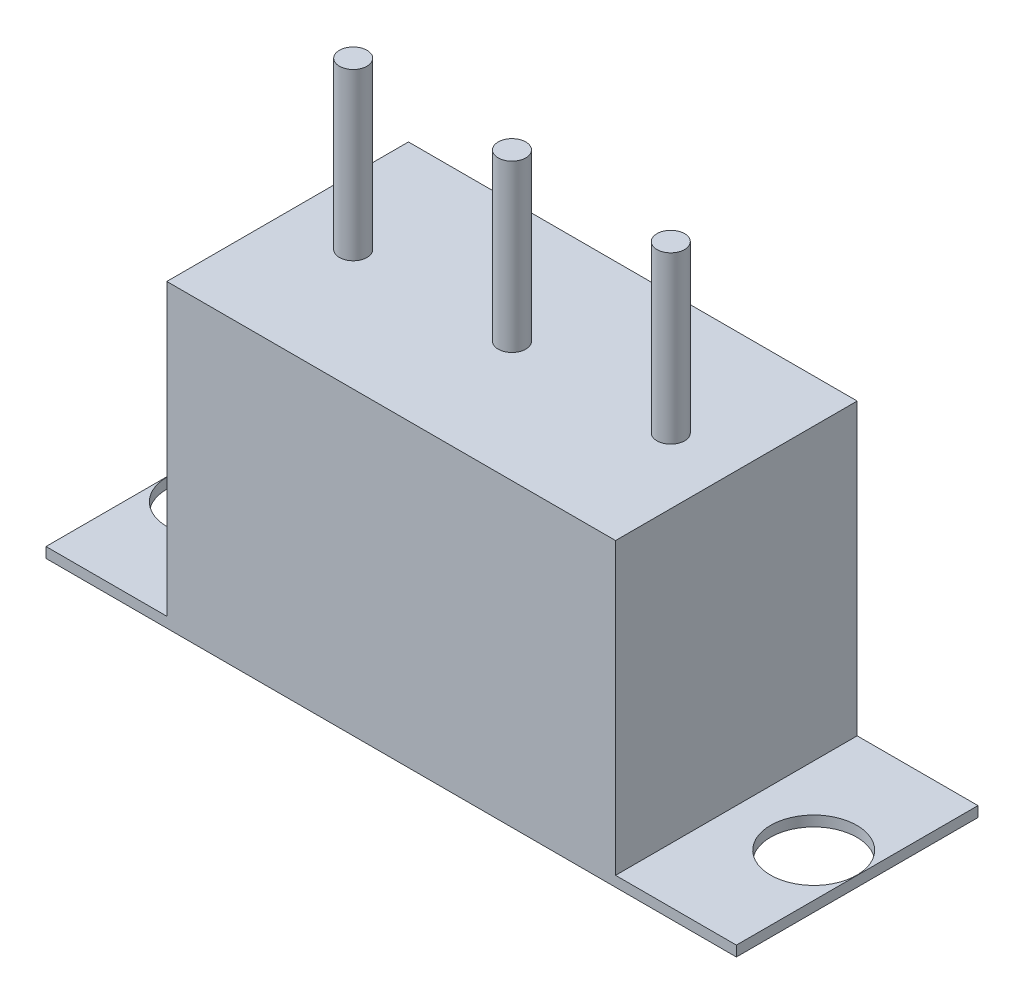
ISO-10303-21;
HEADER;
FILE_DESCRIPTION(('STEP AP214'),'2;1');
FILE_NAME('part.step','',(''),(''),'','','');
FILE_SCHEMA(('AUTOMOTIVE_DESIGN { 1 0 10303 214 1 1 1 1 }'));
ENDSEC;
DATA;
#1=APPLICATION_CONTEXT('core data for automotive mechanical design processes');
#2=APPLICATION_PROTOCOL_DEFINITION('international standard','automotive_design',2000,#1);
#3=PRODUCT_CONTEXT('',#1,'mechanical');
#4=PRODUCT('Part','Part','',(#3));
#5=PRODUCT_RELATED_PRODUCT_CATEGORY('part','',(#4));
#6=PRODUCT_DEFINITION_FORMATION('','',#4);
#7=PRODUCT_DEFINITION_CONTEXT('part definition',#1,'design');
#8=PRODUCT_DEFINITION('design','',#6,#7);
#9=PRODUCT_DEFINITION_SHAPE('','',#8);
#10=(LENGTH_UNIT() NAMED_UNIT(*) SI_UNIT(.MILLI.,.METRE.));
#11=(NAMED_UNIT(*) PLANE_ANGLE_UNIT() SI_UNIT($,.RADIAN.));
#12=(NAMED_UNIT(*) SI_UNIT($,.STERADIAN.) SOLID_ANGLE_UNIT());
#13=UNCERTAINTY_MEASURE_WITH_UNIT(LENGTH_MEASURE(1.E-05),#10,'distance_accuracy_value','');
#14=(GEOMETRIC_REPRESENTATION_CONTEXT(3) GLOBAL_UNCERTAINTY_ASSIGNED_CONTEXT((#13)) GLOBAL_UNIT_ASSIGNED_CONTEXT((#10,
#11,#12)) REPRESENTATION_CONTEXT('',''));
#15=CARTESIAN_POINT('',(0.,0.,0.));
#16=DIRECTION('',(0.,0.,1.));
#17=DIRECTION('',(1.,0.,0.));
#18=AXIS2_PLACEMENT_3D('',#15,#16,#17);
#19=CARTESIAN_POINT('',(0.,8.7,0.));
#20=DIRECTION('',(0.,1.,0.));
#21=DIRECTION('',(0.,0.,1.));
#22=AXIS2_PLACEMENT_3D('',#19,#20,#21);
#23=PLANE('',#22);
#24=CARTESIAN_POINT('',(0.,8.7,0.));
#25=DIRECTION('',(0.,1.,0.));
#26=DIRECTION('',(0.,0.,1.));
#27=AXIS2_PLACEMENT_3D('',#24,#25,#26);
#28=CIRCLE('',#27,0.4);
#29=CARTESIAN_POINT('',(0.,8.7,0.4));
#30=VERTEX_POINT('',#29);
#31=EDGE_CURVE('E174',#30,#30,#28,.T.);
#32=ORIENTED_EDGE('',*,*,#31,.F.);
#33=EDGE_LOOP('',(#32));
#34=FACE_BOUND('',#33,.T.);
#35=DIRECTION('',(0.,0.,1.));
#36=VECTOR('',#35,1.);
#37=CARTESIAN_POINT('',(-6.5,8.7,3.5));
#38=LINE('',#37,#36);
#39=CARTESIAN_POINT('',(-6.5,8.7,-3.5));
#40=VERTEX_POINT('',#39);
#41=CARTESIAN_POINT('',(-6.5,8.7,3.5));
#42=VERTEX_POINT('',#41);
#43=EDGE_CURVE('E109',#40,#42,#38,.T.);
#44=ORIENTED_EDGE('',*,*,#43,.T.);
#45=DIRECTION('',(1.,0.,0.));
#46=VECTOR('',#45,1.);
#47=CARTESIAN_POINT('',(6.5,8.7,3.5));
#48=LINE('',#47,#46);
#49=CARTESIAN_POINT('',(6.5,8.7,3.5));
#50=VERTEX_POINT('',#49);
#51=EDGE_CURVE('E99',#42,#50,#48,.T.);
#52=ORIENTED_EDGE('',*,*,#51,.T.);
#53=DIRECTION('',(0.,0.,-1.));
#54=VECTOR('',#53,1.);
#55=CARTESIAN_POINT('',(6.5,8.7,3.5));
#56=LINE('',#55,#54);
#57=CARTESIAN_POINT('',(6.5,8.7,-3.5));
#58=VERTEX_POINT('',#57);
#59=EDGE_CURVE('E108',#50,#58,#56,.T.);
#60=ORIENTED_EDGE('',*,*,#59,.T.);
#61=DIRECTION('',(-1.,0.,0.));
#62=VECTOR('',#61,1.);
#63=CARTESIAN_POINT('',(6.5,8.7,-3.5));
#64=LINE('',#63,#62);
#65=EDGE_CURVE('E114',#58,#40,#64,.T.);
#66=ORIENTED_EDGE('',*,*,#65,.T.);
#67=EDGE_LOOP('',(#44,#52,#60,#66));
#68=FACE_BOUND('',#67,.T.);
#69=CARTESIAN_POINT('',(-4.6,8.7,0.));
#70=DIRECTION('',(0.,1.,0.));
#71=DIRECTION('',(0.,0.,1.));
#72=AXIS2_PLACEMENT_3D('',#69,#70,#71);
#73=CIRCLE('',#72,0.4);
#74=CARTESIAN_POINT('',(-4.6,8.7,0.4));
#75=VERTEX_POINT('',#74);
#76=EDGE_CURVE('E168',#75,#75,#73,.T.);
#77=ORIENTED_EDGE('',*,*,#76,.F.);
#78=EDGE_LOOP('',(#77));
#79=FACE_BOUND('',#78,.T.);
#80=CARTESIAN_POINT('',(4.6,8.7,0.));
#81=DIRECTION('',(0.,1.,0.));
#82=DIRECTION('',(0.,0.,1.));
#83=AXIS2_PLACEMENT_3D('',#80,#81,#82);
#84=CIRCLE('',#83,0.4);
#85=CARTESIAN_POINT('',(4.6,8.7,0.4));
#86=VERTEX_POINT('',#85);
#87=EDGE_CURVE('E180',#86,#86,#84,.T.);
#88=ORIENTED_EDGE('',*,*,#87,.F.);
#89=EDGE_LOOP('',(#88));
#90=FACE_BOUND('',#89,.T.);
#91=ADVANCED_FACE('F32',(#34,#68,#79,#90),#23,.T.);
#92=CARTESIAN_POINT('',(0.,0.3,0.));
#93=DIRECTION('',(0.,1.,0.));
#94=DIRECTION('',(0.,0.,1.));
#95=AXIS2_PLACEMENT_3D('',#92,#93,#94);
#96=PLANE('',#95);
#97=CARTESIAN_POINT('',(-8.74,0.3,0.));
#98=DIRECTION('',(0.,1.,0.));
#99=DIRECTION('',(0.,0.,1.));
#100=AXIS2_PLACEMENT_3D('',#97,#98,#99);
#101=CIRCLE('',#100,1.25);
#102=CARTESIAN_POINT('',(-8.74,0.3,1.25));
#103=VERTEX_POINT('',#102);
#104=EDGE_CURVE('E158',#103,#103,#101,.T.);
#105=ORIENTED_EDGE('',*,*,#104,.F.);
#106=EDGE_LOOP('',(#105));
#107=FACE_BOUND('',#106,.T.);
#108=DIRECTION('',(0.,0.,1.));
#109=VECTOR('',#108,1.);
#110=CARTESIAN_POINT('',(-6.5,0.3,3.5));
#111=LINE('',#110,#109);
#112=CARTESIAN_POINT('',(-6.5,0.3,-3.5));
#113=VERTEX_POINT('',#112);
#114=CARTESIAN_POINT('',(-6.5,0.3,3.5));
#115=VERTEX_POINT('',#114);
#116=EDGE_CURVE('E49',#113,#115,#111,.T.);
#117=ORIENTED_EDGE('',*,*,#116,.F.);
#118=DIRECTION('',(-1.,0.,0.));
#119=VECTOR('',#118,1.);
#120=CARTESIAN_POINT('',(10.,0.3,-3.5));
#121=LINE('',#120,#119);
#122=CARTESIAN_POINT('',(-10.,0.3,-3.5));
#123=VERTEX_POINT('',#122);
#124=EDGE_CURVE('E146',#113,#123,#121,.T.);
#125=ORIENTED_EDGE('',*,*,#124,.T.);
#126=DIRECTION('',(0.,0.,1.));
#127=VECTOR('',#126,1.);
#128=CARTESIAN_POINT('',(-10.,0.3,3.5));
#129=LINE('',#128,#127);
#130=CARTESIAN_POINT('',(-10.,0.3,3.5));
#131=VERTEX_POINT('',#130);
#132=EDGE_CURVE('E141',#123,#131,#129,.T.);
#133=ORIENTED_EDGE('',*,*,#132,.T.);
#134=DIRECTION('',(1.,0.,0.));
#135=VECTOR('',#134,1.);
#136=CARTESIAN_POINT('',(10.,0.3,3.5));
#137=LINE('',#136,#135);
#138=EDGE_CURVE('E249',#131,#115,#137,.T.);
#139=ORIENTED_EDGE('',*,*,#138,.T.);
#140=EDGE_LOOP('',(#117,#125,#133,#139));
#141=FACE_BOUND('',#140,.T.);
#142=ADVANCED_FACE('F196',(#107,#141),#96,.T.);
#143=CARTESIAN_POINT('',(-10.,0.3,3.5));
#144=DIRECTION('',(1.,0.,0.));
#145=DIRECTION('',(0.,0.,-1.));
#146=AXIS2_PLACEMENT_3D('',#143,#144,#145);
#147=PLANE('',#146);
#148=DIRECTION('',(0.,0.,1.));
#149=VECTOR('',#148,1.);
#150=CARTESIAN_POINT('',(-10.,0.,3.5));
#151=LINE('',#150,#149);
#152=CARTESIAN_POINT('',(-10.,0.,-3.5));
#153=VERTEX_POINT('',#152);
#154=CARTESIAN_POINT('',(-10.,0.,3.5));
#155=VERTEX_POINT('',#154);
#156=EDGE_CURVE('E120',#153,#155,#151,.T.);
#157=ORIENTED_EDGE('',*,*,#156,.T.);
#158=DIRECTION('',(0.,-1.,0.));
#159=VECTOR('',#158,1.);
#160=CARTESIAN_POINT('',(-10.,0.3,3.5));
#161=LINE('',#160,#159);
#162=EDGE_CURVE('E11',#131,#155,#161,.T.);
#163=ORIENTED_EDGE('',*,*,#162,.F.);
#164=ORIENTED_EDGE('',*,*,#132,.F.);
#165=DIRECTION('',(0.,-1.,0.));
#166=VECTOR('',#165,1.);
#167=CARTESIAN_POINT('',(-10.,0.3,-3.5));
#168=LINE('',#167,#166);
#169=EDGE_CURVE('E240',#123,#153,#168,.T.);
#170=ORIENTED_EDGE('',*,*,#169,.T.);
#171=EDGE_LOOP('',(#157,#163,#164,#170));
#172=FACE_BOUND('',#171,.T.);
#173=ADVANCED_FACE('F34',(#172),#147,.F.);
#174=CARTESIAN_POINT('',(10.,0.3,3.5));
#175=DIRECTION('',(0.,0.,-1.));
#176=DIRECTION('',(-1.,0.,0.));
#177=AXIS2_PLACEMENT_3D('',#174,#175,#176);
#178=PLANE('',#177);
#179=DIRECTION('',(1.,0.,0.));
#180=VECTOR('',#179,1.);
#181=CARTESIAN_POINT('',(10.,0.,3.5));
#182=LINE('',#181,#180);
#183=CARTESIAN_POINT('',(10.,0.,3.5));
#184=VERTEX_POINT('',#183);
#185=EDGE_CURVE('E123',#155,#184,#182,.T.);
#186=ORIENTED_EDGE('',*,*,#185,.T.);
#187=DIRECTION('',(0.,-1.,0.));
#188=VECTOR('',#187,1.);
#189=CARTESIAN_POINT('',(10.,0.3,3.5));
#190=LINE('',#189,#188);
#191=CARTESIAN_POINT('',(10.,0.3,3.5));
#192=VERTEX_POINT('',#191);
#193=EDGE_CURVE('E41',#192,#184,#190,.T.);
#194=ORIENTED_EDGE('',*,*,#193,.F.);
#195=CARTESIAN_POINT('',(6.5,0.3,3.5));
#196=VERTEX_POINT('',#195);
#197=EDGE_CURVE('E252',#196,#192,#137,.T.);
#198=ORIENTED_EDGE('',*,*,#197,.F.);
#199=DIRECTION('',(0.,-1.,0.));
#200=VECTOR('',#199,1.);
#201=CARTESIAN_POINT('',(6.5,8.7,3.5));
#202=LINE('',#201,#200);
#203=EDGE_CURVE('E105',#50,#196,#202,.T.);
#204=ORIENTED_EDGE('',*,*,#203,.F.);
#205=ORIENTED_EDGE('',*,*,#51,.F.);
#206=DIRECTION('',(0.,-1.,0.));
#207=VECTOR('',#206,1.);
#208=CARTESIAN_POINT('',(-6.5,8.7,3.5));
#209=LINE('',#208,#207);
#210=EDGE_CURVE('E103',#42,#115,#209,.T.);
#211=ORIENTED_EDGE('',*,*,#210,.T.);
#212=ORIENTED_EDGE('',*,*,#138,.F.);
#213=ORIENTED_EDGE('',*,*,#162,.T.);
#214=EDGE_LOOP('',(#186,#194,#198,#204,#205,#211,#212,#213));
#215=FACE_BOUND('',#214,.T.);
#216=ADVANCED_FACE('F101',(#215),#178,.F.);
#217=CARTESIAN_POINT('',(10.,0.3,3.5));
#218=DIRECTION('',(-1.,0.,0.));
#219=DIRECTION('',(0.,0.,1.));
#220=AXIS2_PLACEMENT_3D('',#217,#218,#219);
#221=PLANE('',#220);
#222=DIRECTION('',(0.,0.,-1.));
#223=VECTOR('',#222,1.);
#224=CARTESIAN_POINT('',(10.,0.,3.5));
#225=LINE('',#224,#223);
#226=CARTESIAN_POINT('',(10.,0.,-3.5));
#227=VERTEX_POINT('',#226);
#228=EDGE_CURVE('E245',#184,#227,#225,.T.);
#229=ORIENTED_EDGE('',*,*,#228,.T.);
#230=DIRECTION('',(0.,-1.,0.));
#231=VECTOR('',#230,1.);
#232=CARTESIAN_POINT('',(10.,0.3,-3.5));
#233=LINE('',#232,#231);
#234=CARTESIAN_POINT('',(10.,0.3,-3.5));
#235=VERTEX_POINT('',#234);
#236=EDGE_CURVE('E260',#235,#227,#233,.T.);
#237=ORIENTED_EDGE('',*,*,#236,.F.);
#238=DIRECTION('',(0.,0.,-1.));
#239=VECTOR('',#238,1.);
#240=CARTESIAN_POINT('',(10.,0.3,3.5));
#241=LINE('',#240,#239);
#242=EDGE_CURVE('E251',#192,#235,#241,.T.);
#243=ORIENTED_EDGE('',*,*,#242,.F.);
#244=ORIENTED_EDGE('',*,*,#193,.T.);
#245=EDGE_LOOP('',(#229,#237,#243,#244));
#246=FACE_BOUND('',#245,.T.);
#247=ADVANCED_FACE('F225',(#246),#221,.F.);
#248=CARTESIAN_POINT('',(10.,0.3,-3.5));
#249=DIRECTION('',(0.,0.,1.));
#250=DIRECTION('',(1.,0.,0.));
#251=AXIS2_PLACEMENT_3D('',#248,#249,#250);
#252=PLANE('',#251);
#253=DIRECTION('',(-1.,0.,0.));
#254=VECTOR('',#253,1.);
#255=CARTESIAN_POINT('',(10.,0.,-3.5));
#256=LINE('',#255,#254);
#257=EDGE_CURVE('E244',#227,#153,#256,.T.);
#258=ORIENTED_EDGE('',*,*,#257,.T.);
#259=ORIENTED_EDGE('',*,*,#169,.F.);
#260=ORIENTED_EDGE('',*,*,#124,.F.);
#261=DIRECTION('',(0.,-1.,0.));
#262=VECTOR('',#261,1.);
#263=CARTESIAN_POINT('',(-6.5,8.7,-3.5));
#264=LINE('',#263,#262);
#265=EDGE_CURVE('E134',#40,#113,#264,.T.);
#266=ORIENTED_EDGE('',*,*,#265,.F.);
#267=ORIENTED_EDGE('',*,*,#65,.F.);
#268=DIRECTION('',(0.,-1.,0.));
#269=VECTOR('',#268,1.);
#270=CARTESIAN_POINT('',(6.5,8.7,-3.5));
#271=LINE('',#270,#269);
#272=CARTESIAN_POINT('',(6.5,0.3,-3.5));
#273=VERTEX_POINT('',#272);
#274=EDGE_CURVE('E125',#58,#273,#271,.T.);
#275=ORIENTED_EDGE('',*,*,#274,.T.);
#276=EDGE_CURVE('E261',#235,#273,#121,.T.);
#277=ORIENTED_EDGE('',*,*,#276,.F.);
#278=ORIENTED_EDGE('',*,*,#236,.T.);
#279=EDGE_LOOP('',(#258,#259,#260,#266,#267,#275,#277,#278));
#280=FACE_BOUND('',#279,.T.);
#281=ADVANCED_FACE('F218',(#280),#252,.F.);
#282=CARTESIAN_POINT('',(8.74,0.3,0.));
#283=DIRECTION('',(0.,1.,0.));
#284=DIRECTION('',(0.,0.,1.));
#285=AXIS2_PLACEMENT_3D('',#282,#283,#284);
#286=CIRCLE('',#285,1.25);
#287=CARTESIAN_POINT('',(8.74,0.3,1.25));
#288=VERTEX_POINT('',#287);
#289=EDGE_CURVE('E164',#288,#288,#286,.T.);
#290=ORIENTED_EDGE('',*,*,#289,.F.);
#291=EDGE_LOOP('',(#290));
#292=FACE_BOUND('',#291,.T.);
#293=DIRECTION('',(0.,0.,-1.));
#294=VECTOR('',#293,1.);
#295=CARTESIAN_POINT('',(6.5,0.3,3.5));
#296=LINE('',#295,#294);
#297=EDGE_CURVE('E57',#196,#273,#296,.T.);
#298=ORIENTED_EDGE('',*,*,#297,.F.);
#299=ORIENTED_EDGE('',*,*,#197,.T.);
#300=ORIENTED_EDGE('',*,*,#242,.T.);
#301=ORIENTED_EDGE('',*,*,#276,.T.);
#302=EDGE_LOOP('',(#298,#299,#300,#301));
#303=FACE_BOUND('',#302,.T.);
#304=ADVANCED_FACE('F204',(#292,#303),#96,.T.);
#305=CARTESIAN_POINT('',(0.,0.,0.));
#306=DIRECTION('',(0.,1.,0.));
#307=DIRECTION('',(0.,0.,1.));
#308=AXIS2_PLACEMENT_3D('',#305,#306,#307);
#309=PLANE('',#308);
#310=CARTESIAN_POINT('',(8.74,0.,0.));
#311=DIRECTION('',(0.,1.,0.));
#312=DIRECTION('',(0.,0.,1.));
#313=AXIS2_PLACEMENT_3D('',#310,#311,#312);
#314=CIRCLE('',#313,1.25);
#315=CARTESIAN_POINT('',(8.74,0.,1.25));
#316=VERTEX_POINT('',#315);
#317=EDGE_CURVE('E161',#316,#316,#314,.F.);
#318=ORIENTED_EDGE('',*,*,#317,.F.);
#319=EDGE_LOOP('',(#318));
#320=FACE_BOUND('',#319,.T.);
#321=CARTESIAN_POINT('',(-8.74,0.,0.));
#322=DIRECTION('',(0.,1.,0.));
#323=DIRECTION('',(0.,0.,1.));
#324=AXIS2_PLACEMENT_3D('',#321,#322,#323);
#325=CIRCLE('',#324,1.25);
#326=CARTESIAN_POINT('',(-8.74,0.,1.25));
#327=VERTEX_POINT('',#326);
#328=EDGE_CURVE('E133',#327,#327,#325,.F.);
#329=ORIENTED_EDGE('',*,*,#328,.F.);
#330=EDGE_LOOP('',(#329));
#331=FACE_BOUND('',#330,.T.);
#332=ORIENTED_EDGE('',*,*,#156,.F.);
#333=ORIENTED_EDGE('',*,*,#257,.F.);
#334=ORIENTED_EDGE('',*,*,#228,.F.);
#335=ORIENTED_EDGE('',*,*,#185,.F.);
#336=EDGE_LOOP('',(#332,#333,#334,#335));
#337=FACE_BOUND('',#336,.T.);
#338=ADVANCED_FACE('F215',(#320,#331,#337),#309,.F.);
#339=CARTESIAN_POINT('',(-6.5,8.7,3.5));
#340=DIRECTION('',(1.,0.,0.));
#341=DIRECTION('',(0.,0.,-1.));
#342=AXIS2_PLACEMENT_3D('',#339,#340,#341);
#343=PLANE('',#342);
#344=ORIENTED_EDGE('',*,*,#116,.T.);
#345=ORIENTED_EDGE('',*,*,#210,.F.);
#346=ORIENTED_EDGE('',*,*,#43,.F.);
#347=ORIENTED_EDGE('',*,*,#265,.T.);
#348=EDGE_LOOP('',(#344,#345,#346,#347));
#349=FACE_BOUND('',#348,.T.);
#350=ADVANCED_FACE('F119',(#349),#343,.F.);
#351=CARTESIAN_POINT('',(6.5,8.7,3.5));
#352=DIRECTION('',(-1.,0.,0.));
#353=DIRECTION('',(0.,0.,1.));
#354=AXIS2_PLACEMENT_3D('',#351,#352,#353);
#355=PLANE('',#354);
#356=ORIENTED_EDGE('',*,*,#297,.T.);
#357=ORIENTED_EDGE('',*,*,#274,.F.);
#358=ORIENTED_EDGE('',*,*,#59,.F.);
#359=ORIENTED_EDGE('',*,*,#203,.T.);
#360=EDGE_LOOP('',(#356,#357,#358,#359));
#361=FACE_BOUND('',#360,.T.);
#362=ADVANCED_FACE('F210',(#361),#355,.F.);
#363=CARTESIAN_POINT('',(-8.74,-0.00100000000000002,0.));
#364=DIRECTION('',(0.,1.,0.));
#365=DIRECTION('',(0.,0.,1.));
#366=AXIS2_PLACEMENT_3D('',#363,#364,#365);
#367=CYLINDRICAL_SURFACE('',#366,1.25);
#368=ORIENTED_EDGE('',*,*,#104,.T.);
#369=EDGE_LOOP('',(#368));
#370=FACE_BOUND('',#369,.T.);
#371=ORIENTED_EDGE('',*,*,#328,.T.);
#372=EDGE_LOOP('',(#371));
#373=FACE_BOUND('',#372,.T.);
#374=ADVANCED_FACE('F208',(#370,#373),#367,.F.);
#375=CARTESIAN_POINT('',(8.74,-0.00100000000000002,0.));
#376=DIRECTION('',(0.,1.,0.));
#377=DIRECTION('',(0.,0.,1.));
#378=AXIS2_PLACEMENT_3D('',#375,#376,#377);
#379=CYLINDRICAL_SURFACE('',#378,1.25);
#380=ORIENTED_EDGE('',*,*,#289,.T.);
#381=EDGE_LOOP('',(#380));
#382=FACE_BOUND('',#381,.T.);
#383=ORIENTED_EDGE('',*,*,#317,.T.);
#384=EDGE_LOOP('',(#383));
#385=FACE_BOUND('',#384,.T.);
#386=ADVANCED_FACE('F302',(#382,#385),#379,.F.);
#387=CARTESIAN_POINT('',(-4.6,13.5,0.));
#388=DIRECTION('',(0.,-1.,0.));
#389=DIRECTION('',(0.,0.,-1.));
#390=AXIS2_PLACEMENT_3D('',#387,#388,#389);
#391=CYLINDRICAL_SURFACE('',#390,0.4);
#392=CARTESIAN_POINT('',(-4.6,13.5,0.));
#393=DIRECTION('',(0.,1.,0.));
#394=DIRECTION('',(0.,0.,1.));
#395=AXIS2_PLACEMENT_3D('',#392,#393,#394);
#396=CIRCLE('',#395,0.4);
#397=CARTESIAN_POINT('',(-4.6,13.5,0.4));
#398=VERTEX_POINT('',#397);
#399=EDGE_CURVE('E167',#398,#398,#396,.T.);
#400=ORIENTED_EDGE('',*,*,#399,.F.);
#401=EDGE_LOOP('',(#400));
#402=FACE_BOUND('',#401,.T.);
#403=ORIENTED_EDGE('',*,*,#76,.T.);
#404=EDGE_LOOP('',(#403));
#405=FACE_BOUND('',#404,.T.);
#406=ADVANCED_FACE('F310',(#402,#405),#391,.T.);
#407=CARTESIAN_POINT('',(-4.6,13.5,0.));
#408=DIRECTION('',(0.,1.,0.));
#409=DIRECTION('',(0.,0.,1.));
#410=AXIS2_PLACEMENT_3D('',#407,#408,#409);
#411=PLANE('',#410);
#412=ORIENTED_EDGE('',*,*,#399,.T.);
#413=EDGE_LOOP('',(#412));
#414=FACE_BOUND('',#413,.T.);
#415=ADVANCED_FACE('F324',(#414),#411,.T.);
#416=CARTESIAN_POINT('',(0.,13.5,0.));
#417=DIRECTION('',(0.,-1.,0.));
#418=DIRECTION('',(0.,0.,-1.));
#419=AXIS2_PLACEMENT_3D('',#416,#417,#418);
#420=CYLINDRICAL_SURFACE('',#419,0.4);
#421=CARTESIAN_POINT('',(0.,13.5,0.));
#422=DIRECTION('',(0.,1.,0.));
#423=DIRECTION('',(0.,0.,1.));
#424=AXIS2_PLACEMENT_3D('',#421,#422,#423);
#425=CIRCLE('',#424,0.4);
#426=CARTESIAN_POINT('',(0.,13.5,0.4));
#427=VERTEX_POINT('',#426);
#428=EDGE_CURVE('E171',#427,#427,#425,.T.);
#429=ORIENTED_EDGE('',*,*,#428,.F.);
#430=EDGE_LOOP('',(#429));
#431=FACE_BOUND('',#430,.T.);
#432=ORIENTED_EDGE('',*,*,#31,.T.);
#433=EDGE_LOOP('',(#432));
#434=FACE_BOUND('',#433,.T.);
#435=ADVANCED_FACE('F334',(#431,#434),#420,.T.);
#436=CARTESIAN_POINT('',(0.,13.5,0.));
#437=DIRECTION('',(0.,1.,0.));
#438=DIRECTION('',(0.,0.,1.));
#439=AXIS2_PLACEMENT_3D('',#436,#437,#438);
#440=PLANE('',#439);
#441=ORIENTED_EDGE('',*,*,#428,.T.);
#442=EDGE_LOOP('',(#441));
#443=FACE_BOUND('',#442,.T.);
#444=ADVANCED_FACE('F191',(#443),#440,.T.);
#445=CARTESIAN_POINT('',(4.6,13.5,0.));
#446=DIRECTION('',(0.,-1.,0.));
#447=DIRECTION('',(0.,0.,-1.));
#448=AXIS2_PLACEMENT_3D('',#445,#446,#447);
#449=CYLINDRICAL_SURFACE('',#448,0.4);
#450=CARTESIAN_POINT('',(4.6,13.5,0.));
#451=DIRECTION('',(0.,1.,0.));
#452=DIRECTION('',(0.,0.,1.));
#453=AXIS2_PLACEMENT_3D('',#450,#451,#452);
#454=CIRCLE('',#453,0.4);
#455=CARTESIAN_POINT('',(4.6,13.5,0.4));
#456=VERTEX_POINT('',#455);
#457=EDGE_CURVE('E177',#456,#456,#454,.T.);
#458=ORIENTED_EDGE('',*,*,#457,.F.);
#459=EDGE_LOOP('',(#458));
#460=FACE_BOUND('',#459,.T.);
#461=ORIENTED_EDGE('',*,*,#87,.T.);
#462=EDGE_LOOP('',(#461));
#463=FACE_BOUND('',#462,.T.);
#464=ADVANCED_FACE('F188',(#460,#463),#449,.T.);
#465=CARTESIAN_POINT('',(4.6,13.5,0.));
#466=DIRECTION('',(0.,1.,0.));
#467=DIRECTION('',(0.,0.,1.));
#468=AXIS2_PLACEMENT_3D('',#465,#466,#467);
#469=PLANE('',#468);
#470=ORIENTED_EDGE('',*,*,#457,.T.);
#471=EDGE_LOOP('',(#470));
#472=FACE_BOUND('',#471,.T.);
#473=ADVANCED_FACE('F186',(#472),#469,.T.);
#474=CLOSED_SHELL('',(#91,#142,#173,#216,#247,#281,#304,#338,#350,#362,#374,#386,#406,#415,#435,
#444,#464,#473));
#475=MANIFOLD_SOLID_BREP('B2',#474);
#476=ADVANCED_BREP_SHAPE_REPRESENTATION('',(#18,#475),#14);
#477=SHAPE_DEFINITION_REPRESENTATION(#9,#476);
ENDSEC;
END-ISO-10303-21;
